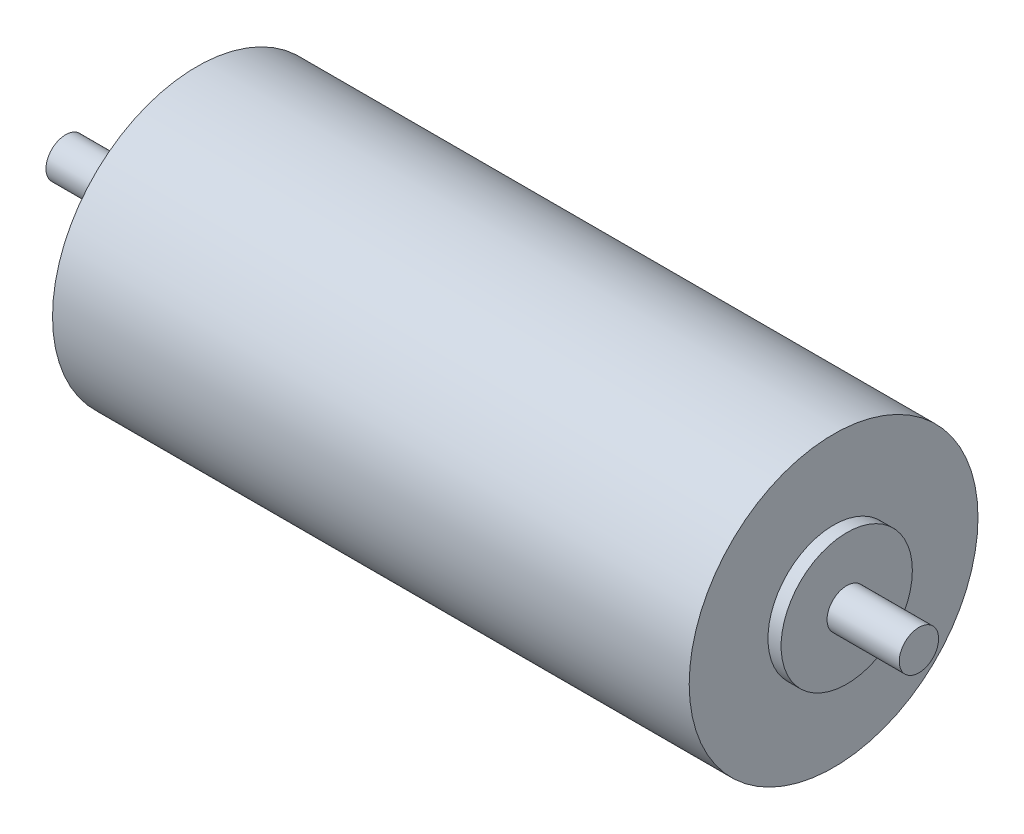
ISO-10303-21;
HEADER;
FILE_DESCRIPTION(('STEP AP214'),'2;1');
FILE_NAME('part.step','',(''),(''),'','','');
FILE_SCHEMA(('AUTOMOTIVE_DESIGN { 1 0 10303 214 1 1 1 1 }'));
ENDSEC;
DATA;
#1=APPLICATION_CONTEXT('core data for automotive mechanical design processes');
#2=APPLICATION_PROTOCOL_DEFINITION('international standard','automotive_design',2000,#1);
#3=PRODUCT_CONTEXT('',#1,'mechanical');
#4=PRODUCT('Part','Part','',(#3));
#5=PRODUCT_RELATED_PRODUCT_CATEGORY('part','',(#4));
#6=PRODUCT_DEFINITION_FORMATION('','',#4);
#7=PRODUCT_DEFINITION_CONTEXT('part definition',#1,'design');
#8=PRODUCT_DEFINITION('design','',#6,#7);
#9=PRODUCT_DEFINITION_SHAPE('','',#8);
#10=(LENGTH_UNIT() NAMED_UNIT(*) SI_UNIT(.MILLI.,.METRE.));
#11=(NAMED_UNIT(*) PLANE_ANGLE_UNIT() SI_UNIT($,.RADIAN.));
#12=(NAMED_UNIT(*) SI_UNIT($,.STERADIAN.) SOLID_ANGLE_UNIT());
#13=UNCERTAINTY_MEASURE_WITH_UNIT(LENGTH_MEASURE(1.E-05),#10,'distance_accuracy_value','');
#14=(GEOMETRIC_REPRESENTATION_CONTEXT(3) GLOBAL_UNCERTAINTY_ASSIGNED_CONTEXT((#13)) GLOBAL_UNIT_ASSIGNED_CONTEXT((#10,
#11,#12)) REPRESENTATION_CONTEXT('',''));
#15=CARTESIAN_POINT('',(0.,0.,0.));
#16=DIRECTION('',(0.,0.,1.));
#17=DIRECTION('',(1.,0.,0.));
#18=AXIS2_PLACEMENT_3D('',#15,#16,#17);
#19=CARTESIAN_POINT('',(-10.,0.,0.));
#20=DIRECTION('',(-1.,0.,0.));
#21=DIRECTION('',(0.,0.,1.));
#22=AXIS2_PLACEMENT_3D('',#19,#20,#21);
#23=PLANE('',#22);
#24=CARTESIAN_POINT('',(-10.,0.,0.));
#25=DIRECTION('',(1.,0.,0.));
#26=DIRECTION('',(0.,0.,-1.));
#27=AXIS2_PLACEMENT_3D('',#24,#25,#26);
#28=CIRCLE('',#27,1.5);
#29=CARTESIAN_POINT('',(-10.,0.,-1.5));
#30=VERTEX_POINT('',#29);
#31=EDGE_CURVE('E10',#30,#30,#28,.T.);
#32=ORIENTED_EDGE('',*,*,#31,.F.);
#33=EDGE_LOOP('',(#32));
#34=FACE_BOUND('',#33,.T.);
#35=ADVANCED_FACE('F32',(#34),#23,.T.);
#36=CARTESIAN_POINT('',(56.6731335050359,0.,0.));
#37=DIRECTION('',(1.,0.,0.));
#38=DIRECTION('',(0.,0.,-1.));
#39=AXIS2_PLACEMENT_3D('',#36,#37,#38);
#40=CYLINDRICAL_SURFACE('',#39,1.5);
#41=ORIENTED_EDGE('',*,*,#31,.T.);
#42=EDGE_LOOP('',(#41));
#43=FACE_BOUND('',#42,.T.);
#44=CARTESIAN_POINT('',(-1.,0.,0.));
#45=DIRECTION('',(1.,0.,0.));
#46=DIRECTION('',(0.,0.,-1.));
#47=AXIS2_PLACEMENT_3D('',#44,#45,#46);
#48=CIRCLE('',#47,1.5);
#49=CARTESIAN_POINT('',(-1.,0.,-1.5));
#50=VERTEX_POINT('',#49);
#51=EDGE_CURVE('E38',#50,#50,#48,.T.);
#52=ORIENTED_EDGE('',*,*,#51,.F.);
#53=EDGE_LOOP('',(#52));
#54=FACE_BOUND('',#53,.T.);
#55=ADVANCED_FACE('F86',(#43,#54),#40,.T.);
#56=CARTESIAN_POINT('',(-1.,1.5,0.));
#57=DIRECTION('',(-1.,0.,0.));
#58=DIRECTION('',(0.,0.,1.));
#59=AXIS2_PLACEMENT_3D('',#56,#57,#58);
#60=PLANE('',#59);
#61=ORIENTED_EDGE('',*,*,#51,.T.);
#62=EDGE_LOOP('',(#61));
#63=FACE_BOUND('',#62,.T.);
#64=CARTESIAN_POINT('',(-1.,0.,0.));
#65=DIRECTION('',(1.,0.,0.));
#66=DIRECTION('',(0.,0.,-1.));
#67=AXIS2_PLACEMENT_3D('',#64,#65,#66);
#68=CIRCLE('',#67,5.);
#69=CARTESIAN_POINT('',(-1.,0.,-5.));
#70=VERTEX_POINT('',#69);
#71=EDGE_CURVE('E42',#70,#70,#68,.T.);
#72=ORIENTED_EDGE('',*,*,#71,.F.);
#73=EDGE_LOOP('',(#72));
#74=FACE_BOUND('',#73,.T.);
#75=ADVANCED_FACE('F91',(#63,#74),#60,.T.);
#76=CARTESIAN_POINT('',(56.6731335050359,0.,0.));
#77=DIRECTION('',(1.,0.,0.));
#78=DIRECTION('',(0.,0.,-1.));
#79=AXIS2_PLACEMENT_3D('',#76,#77,#78);
#80=CYLINDRICAL_SURFACE('',#79,5.);
#81=ORIENTED_EDGE('',*,*,#71,.T.);
#82=EDGE_LOOP('',(#81));
#83=FACE_BOUND('',#82,.T.);
#84=CARTESIAN_POINT('',(0.,0.,0.));
#85=DIRECTION('',(1.,0.,0.));
#86=DIRECTION('',(0.,0.,-1.));
#87=AXIS2_PLACEMENT_3D('',#84,#85,#86);
#88=CIRCLE('',#87,5.);
#89=CARTESIAN_POINT('',(0.,0.,-5.));
#90=VERTEX_POINT('',#89);
#91=EDGE_CURVE('E46',#90,#90,#88,.T.);
#92=ORIENTED_EDGE('',*,*,#91,.F.);
#93=EDGE_LOOP('',(#92));
#94=FACE_BOUND('',#93,.T.);
#95=ADVANCED_FACE('F95',(#83,#94),#80,.T.);
#96=CARTESIAN_POINT('',(0.,5.,0.));
#97=DIRECTION('',(-1.,0.,0.));
#98=DIRECTION('',(0.,0.,1.));
#99=AXIS2_PLACEMENT_3D('',#96,#97,#98);
#100=PLANE('',#99);
#101=ORIENTED_EDGE('',*,*,#91,.T.);
#102=EDGE_LOOP('',(#101));
#103=FACE_BOUND('',#102,.T.);
#104=CARTESIAN_POINT('',(0.,0.,0.));
#105=DIRECTION('',(1.,0.,0.));
#106=DIRECTION('',(0.,0.,-1.));
#107=AXIS2_PLACEMENT_3D('',#104,#105,#106);
#108=CIRCLE('',#107,11.);
#109=CARTESIAN_POINT('',(0.,0.,-11.));
#110=VERTEX_POINT('',#109);
#111=EDGE_CURVE('E51',#110,#110,#108,.T.);
#112=ORIENTED_EDGE('',*,*,#111,.F.);
#113=EDGE_LOOP('',(#112));
#114=FACE_BOUND('',#113,.T.);
#115=ADVANCED_FACE('F101',(#103,#114),#100,.T.);
#116=CARTESIAN_POINT('',(56.6731335050359,0.,0.));
#117=DIRECTION('',(1.,0.,0.));
#118=DIRECTION('',(0.,0.,-1.));
#119=AXIS2_PLACEMENT_3D('',#116,#117,#118);
#120=CYLINDRICAL_SURFACE('',#119,11.);
#121=ORIENTED_EDGE('',*,*,#111,.T.);
#122=EDGE_LOOP('',(#121));
#123=FACE_BOUND('',#122,.T.);
#124=CARTESIAN_POINT('',(48.5,0.,0.));
#125=DIRECTION('',(1.,0.,0.));
#126=DIRECTION('',(0.,0.,-1.));
#127=AXIS2_PLACEMENT_3D('',#124,#125,#126);
#128=CIRCLE('',#127,11.);
#129=CARTESIAN_POINT('',(48.5,0.,-11.));
#130=VERTEX_POINT('',#129);
#131=EDGE_CURVE('E54',#130,#130,#128,.T.);
#132=ORIENTED_EDGE('',*,*,#131,.F.);
#133=EDGE_LOOP('',(#132));
#134=FACE_BOUND('',#133,.T.);
#135=ADVANCED_FACE('F105',(#123,#134),#120,.T.);
#136=CARTESIAN_POINT('',(48.5,11.,0.));
#137=DIRECTION('',(1.,0.,0.));
#138=DIRECTION('',(0.,0.,-1.));
#139=AXIS2_PLACEMENT_3D('',#136,#137,#138);
#140=PLANE('',#139);
#141=ORIENTED_EDGE('',*,*,#131,.T.);
#142=EDGE_LOOP('',(#141));
#143=FACE_BOUND('',#142,.T.);
#144=CARTESIAN_POINT('',(48.5,0.,0.));
#145=DIRECTION('',(1.,0.,0.));
#146=DIRECTION('',(0.,0.,-1.));
#147=AXIS2_PLACEMENT_3D('',#144,#145,#146);
#148=CIRCLE('',#147,5.);
#149=CARTESIAN_POINT('',(48.5,0.,-5.));
#150=VERTEX_POINT('',#149);
#151=EDGE_CURVE('E57',#150,#150,#148,.T.);
#152=ORIENTED_EDGE('',*,*,#151,.F.);
#153=EDGE_LOOP('',(#152));
#154=FACE_BOUND('',#153,.T.);
#155=ADVANCED_FACE('F109',(#143,#154),#140,.T.);
#156=CARTESIAN_POINT('',(56.6731335050359,0.,0.));
#157=DIRECTION('',(1.,0.,0.));
#158=DIRECTION('',(0.,0.,-1.));
#159=AXIS2_PLACEMENT_3D('',#156,#157,#158);
#160=CYLINDRICAL_SURFACE('',#159,5.);
#161=ORIENTED_EDGE('',*,*,#151,.T.);
#162=EDGE_LOOP('',(#161));
#163=FACE_BOUND('',#162,.T.);
#164=CARTESIAN_POINT('',(49.5,0.,0.));
#165=DIRECTION('',(1.,0.,0.));
#166=DIRECTION('',(0.,0.,-1.));
#167=AXIS2_PLACEMENT_3D('',#164,#165,#166);
#168=CIRCLE('',#167,5.);
#169=CARTESIAN_POINT('',(49.5,0.,-5.));
#170=VERTEX_POINT('',#169);
#171=EDGE_CURVE('E60',#170,#170,#168,.T.);
#172=ORIENTED_EDGE('',*,*,#171,.F.);
#173=EDGE_LOOP('',(#172));
#174=FACE_BOUND('',#173,.T.);
#175=ADVANCED_FACE('F82',(#163,#174),#160,.T.);
#176=CARTESIAN_POINT('',(49.5,5.,0.));
#177=DIRECTION('',(1.,0.,0.));
#178=DIRECTION('',(0.,0.,-1.));
#179=AXIS2_PLACEMENT_3D('',#176,#177,#178);
#180=PLANE('',#179);
#181=ORIENTED_EDGE('',*,*,#171,.T.);
#182=EDGE_LOOP('',(#181));
#183=FACE_BOUND('',#182,.T.);
#184=CARTESIAN_POINT('',(49.5,0.,0.));
#185=DIRECTION('',(1.,0.,0.));
#186=DIRECTION('',(0.,0.,-1.));
#187=AXIS2_PLACEMENT_3D('',#184,#185,#186);
#188=CIRCLE('',#187,1.5);
#189=CARTESIAN_POINT('',(49.5,0.,-1.5));
#190=VERTEX_POINT('',#189);
#191=EDGE_CURVE('E63',#190,#190,#188,.T.);
#192=ORIENTED_EDGE('',*,*,#191,.F.);
#193=EDGE_LOOP('',(#192));
#194=FACE_BOUND('',#193,.T.);
#195=ADVANCED_FACE('F74',(#183,#194),#180,.T.);
#196=CARTESIAN_POINT('',(56.6731335050359,0.,0.));
#197=DIRECTION('',(1.,0.,0.));
#198=DIRECTION('',(0.,0.,-1.));
#199=AXIS2_PLACEMENT_3D('',#196,#197,#198);
#200=CYLINDRICAL_SURFACE('',#199,1.5);
#201=ORIENTED_EDGE('',*,*,#191,.T.);
#202=EDGE_LOOP('',(#201));
#203=FACE_BOUND('',#202,.T.);
#204=CARTESIAN_POINT('',(55.,0.,0.));
#205=DIRECTION('',(1.,0.,0.));
#206=DIRECTION('',(0.,0.,-1.));
#207=AXIS2_PLACEMENT_3D('',#204,#205,#206);
#208=CIRCLE('',#207,1.5);
#209=CARTESIAN_POINT('',(55.,0.,-1.5));
#210=VERTEX_POINT('',#209);
#211=EDGE_CURVE('E66',#210,#210,#208,.T.);
#212=ORIENTED_EDGE('',*,*,#211,.F.);
#213=EDGE_LOOP('',(#212));
#214=FACE_BOUND('',#213,.T.);
#215=ADVANCED_FACE('F72',(#203,#214),#200,.T.);
#216=CARTESIAN_POINT('',(55.,1.5,0.));
#217=DIRECTION('',(1.,0.,0.));
#218=DIRECTION('',(0.,0.,-1.));
#219=AXIS2_PLACEMENT_3D('',#216,#217,#218);
#220=PLANE('',#219);
#221=ORIENTED_EDGE('',*,*,#211,.T.);
#222=EDGE_LOOP('',(#221));
#223=FACE_BOUND('',#222,.T.);
#224=ADVANCED_FACE('F70',(#223),#220,.T.);
#225=CLOSED_SHELL('',(#35,#55,#75,#95,#115,#135,#155,#175,#195,#215,#224));
#226=MANIFOLD_SOLID_BREP('B2',#225);
#227=ADVANCED_BREP_SHAPE_REPRESENTATION('',(#18,#226),#14);
#228=SHAPE_DEFINITION_REPRESENTATION(#9,#227);
ENDSEC;
END-ISO-10303-21;
